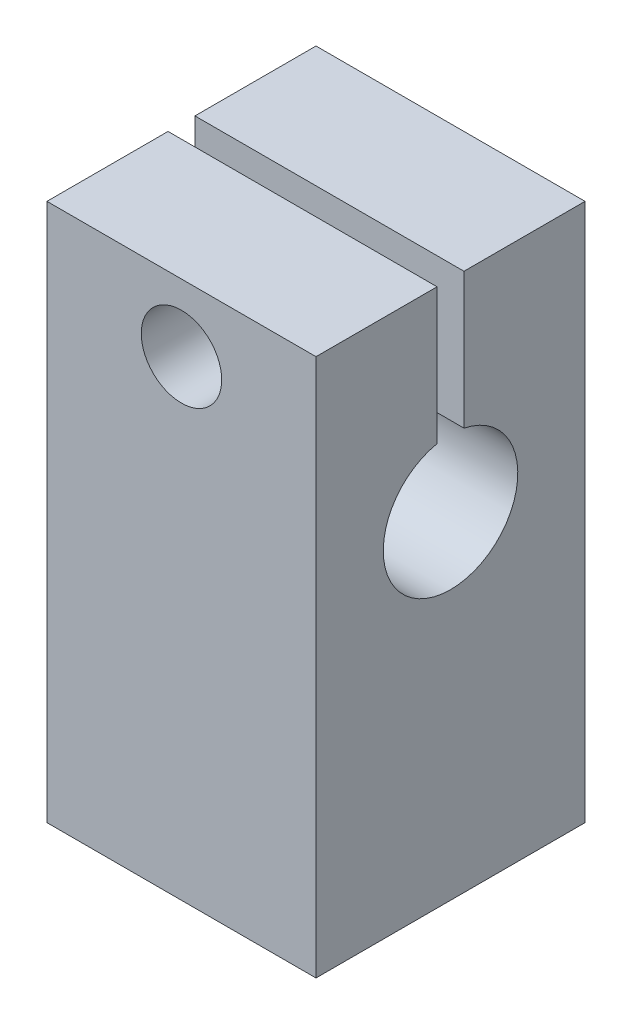
ISO-10303-21;
HEADER;
FILE_DESCRIPTION(('STEP AP214'),'2;1');
FILE_NAME('part.step','',(''),(''),'','','');
FILE_SCHEMA(('AUTOMOTIVE_DESIGN { 1 0 10303 214 1 1 1 1 }'));
ENDSEC;
DATA;
#1=APPLICATION_CONTEXT('core data for automotive mechanical design processes');
#2=APPLICATION_PROTOCOL_DEFINITION('international standard','automotive_design',2000,#1);
#3=PRODUCT_CONTEXT('',#1,'mechanical');
#4=PRODUCT('Part','Part','',(#3));
#5=PRODUCT_RELATED_PRODUCT_CATEGORY('part','',(#4));
#6=PRODUCT_DEFINITION_FORMATION('','',#4);
#7=PRODUCT_DEFINITION_CONTEXT('part definition',#1,'design');
#8=PRODUCT_DEFINITION('design','',#6,#7);
#9=PRODUCT_DEFINITION_SHAPE('','',#8);
#10=(LENGTH_UNIT() NAMED_UNIT(*) SI_UNIT(.MILLI.,.METRE.));
#11=(NAMED_UNIT(*) PLANE_ANGLE_UNIT() SI_UNIT($,.RADIAN.));
#12=(NAMED_UNIT(*) SI_UNIT($,.STERADIAN.) SOLID_ANGLE_UNIT());
#13=UNCERTAINTY_MEASURE_WITH_UNIT(LENGTH_MEASURE(1.E-05),#10,'distance_accuracy_value','');
#14=(GEOMETRIC_REPRESENTATION_CONTEXT(3) GLOBAL_UNCERTAINTY_ASSIGNED_CONTEXT((#13)) GLOBAL_UNIT_ASSIGNED_CONTEXT((#10,
#11,#12)) REPRESENTATION_CONTEXT('',''));
#15=CARTESIAN_POINT('',(0.,0.,0.));
#16=DIRECTION('',(0.,0.,1.));
#17=DIRECTION('',(1.,0.,0.));
#18=AXIS2_PLACEMENT_3D('',#15,#16,#17);
#19=CARTESIAN_POINT('',(0.,25.4,0.));
#20=DIRECTION('',(0.,-1.,0.));
#21=DIRECTION('',(0.,0.,-1.));
#22=AXIS2_PLACEMENT_3D('',#19,#20,#21);
#23=PLANE('',#22);
#24=DIRECTION('',(0.,0.,1.));
#25=VECTOR('',#24,1.);
#26=CARTESIAN_POINT('',(0.,25.4,0.));
#27=LINE('',#26,#25);
#28=CARTESIAN_POINT('',(0.,25.4,-12.7));
#29=VERTEX_POINT('',#28);
#30=CARTESIAN_POINT('',(0.,25.4,-6.985));
#31=VERTEX_POINT('',#30);
#32=EDGE_CURVE('E237',#29,#31,#27,.T.);
#33=ORIENTED_EDGE('',*,*,#32,.T.);
#34=DIRECTION('',(1.,0.,0.));
#35=VECTOR('',#34,1.);
#36=CARTESIAN_POINT('',(0.,25.4,-6.985));
#37=LINE('',#36,#35);
#38=CARTESIAN_POINT('',(12.7,25.4,-6.985));
#39=VERTEX_POINT('',#38);
#40=EDGE_CURVE('E238',#31,#39,#37,.T.);
#41=ORIENTED_EDGE('',*,*,#40,.T.);
#42=DIRECTION('',(0.,0.,-1.));
#43=VECTOR('',#42,1.);
#44=CARTESIAN_POINT('',(12.7,25.4,0.));
#45=LINE('',#44,#43);
#46=CARTESIAN_POINT('',(12.7,25.4,-12.7));
#47=VERTEX_POINT('',#46);
#48=EDGE_CURVE('E248',#39,#47,#45,.T.);
#49=ORIENTED_EDGE('',*,*,#48,.T.);
#50=DIRECTION('',(-1.,0.,0.));
#51=VECTOR('',#50,1.);
#52=CARTESIAN_POINT('',(0.,25.4,-12.7));
#53=LINE('',#52,#51);
#54=EDGE_CURVE('E241',#47,#29,#53,.T.);
#55=ORIENTED_EDGE('',*,*,#54,.T.);
#56=EDGE_LOOP('',(#33,#41,#49,#55));
#57=FACE_BOUND('',#56,.T.);
#58=ADVANCED_FACE('F33',(#57),#23,.F.);
#59=CARTESIAN_POINT('',(0.,25.4,0.));
#60=DIRECTION('',(1.,0.,0.));
#61=DIRECTION('',(0.,0.,-1.));
#62=AXIS2_PLACEMENT_3D('',#59,#60,#61);
#63=PLANE('',#62);
#64=CARTESIAN_POINT('',(0.,15.875,-6.35));
#65=DIRECTION('',(1.,0.,0.));
#66=DIRECTION('',(0.,0.,-1.));
#67=AXIS2_PLACEMENT_3D('',#64,#65,#66);
#68=CIRCLE('',#67,3.175);
#69=CARTESIAN_POINT('',(0.,18.9858519733346,-5.715));
#70=VERTEX_POINT('',#69);
#71=CARTESIAN_POINT('',(0.,18.9858519733346,-6.985));
#72=VERTEX_POINT('',#71);
#73=EDGE_CURVE('E145',#70,#72,#68,.T.);
#74=ORIENTED_EDGE('',*,*,#73,.T.);
#75=DIRECTION('',(0.,1.,0.));
#76=VECTOR('',#75,1.);
#77=CARTESIAN_POINT('',(0.,17.78,-6.985));
#78=LINE('',#77,#76);
#79=EDGE_CURVE('E299',#72,#31,#78,.T.);
#80=ORIENTED_EDGE('',*,*,#79,.T.);
#81=ORIENTED_EDGE('',*,*,#32,.F.);
#82=DIRECTION('',(0.,-1.,0.));
#83=VECTOR('',#82,1.);
#84=CARTESIAN_POINT('',(0.,25.4,-12.7));
#85=LINE('',#84,#83);
#86=CARTESIAN_POINT('',(0.,0.,-12.7));
#87=VERTEX_POINT('',#86);
#88=EDGE_CURVE('E258',#29,#87,#85,.T.);
#89=ORIENTED_EDGE('',*,*,#88,.T.);
#90=DIRECTION('',(0.,0.,1.));
#91=VECTOR('',#90,1.);
#92=CARTESIAN_POINT('',(0.,0.,0.));
#93=LINE('',#92,#91);
#94=CARTESIAN_POINT('',(0.,0.,0.));
#95=VERTEX_POINT('',#94);
#96=EDGE_CURVE('E259',#87,#95,#93,.T.);
#97=ORIENTED_EDGE('',*,*,#96,.T.);
#98=DIRECTION('',(0.,-1.,0.));
#99=VECTOR('',#98,1.);
#100=CARTESIAN_POINT('',(0.,25.4,0.));
#101=LINE('',#100,#99);
#102=CARTESIAN_POINT('',(0.,25.4,0.));
#103=VERTEX_POINT('',#102);
#104=EDGE_CURVE('E150',#103,#95,#101,.T.);
#105=ORIENTED_EDGE('',*,*,#104,.F.);
#106=CARTESIAN_POINT('',(0.,25.4,-5.715));
#107=VERTEX_POINT('',#106);
#108=EDGE_CURVE('E246',#107,#103,#27,.T.);
#109=ORIENTED_EDGE('',*,*,#108,.F.);
#110=DIRECTION('',(0.,-1.,0.));
#111=VECTOR('',#110,1.);
#112=CARTESIAN_POINT('',(0.,17.78,-5.715));
#113=LINE('',#112,#111);
#114=EDGE_CURVE('E297',#107,#70,#113,.T.);
#115=ORIENTED_EDGE('',*,*,#114,.T.);
#116=EDGE_LOOP('',(#74,#80,#81,#89,#97,#105,#109,#115));
#117=FACE_BOUND('',#116,.T.);
#118=ADVANCED_FACE('F168',(#117),#63,.F.);
#119=CARTESIAN_POINT('',(0.,25.4,0.));
#120=DIRECTION('',(0.,0.,-1.));
#121=DIRECTION('',(-1.,0.,0.));
#122=AXIS2_PLACEMENT_3D('',#119,#120,#121);
#123=PLANE('',#122);
#124=CARTESIAN_POINT('',(6.35,22.225,0.));
#125=DIRECTION('',(0.,0.,1.));
#126=DIRECTION('',(1.,0.,0.));
#127=AXIS2_PLACEMENT_3D('',#124,#125,#126);
#128=CIRCLE('',#127,1.89864999999999);
#129=CARTESIAN_POINT('',(8.24864999999999,22.225,0.));
#130=VERTEX_POINT('',#129);
#131=EDGE_CURVE('E314',#130,#130,#128,.T.);
#132=ORIENTED_EDGE('',*,*,#131,.F.);
#133=EDGE_LOOP('',(#132));
#134=FACE_BOUND('',#133,.T.);
#135=DIRECTION('',(1.,0.,0.));
#136=VECTOR('',#135,1.);
#137=CARTESIAN_POINT('',(0.,0.,0.));
#138=LINE('',#137,#136);
#139=CARTESIAN_POINT('',(12.7,0.,0.));
#140=VERTEX_POINT('',#139);
#141=EDGE_CURVE('E262',#95,#140,#138,.T.);
#142=ORIENTED_EDGE('',*,*,#141,.T.);
#143=DIRECTION('',(0.,-1.,0.));
#144=VECTOR('',#143,1.);
#145=CARTESIAN_POINT('',(12.7,25.4,0.));
#146=LINE('',#145,#144);
#147=CARTESIAN_POINT('',(12.7,25.4,0.));
#148=VERTEX_POINT('',#147);
#149=EDGE_CURVE('E270',#148,#140,#146,.T.);
#150=ORIENTED_EDGE('',*,*,#149,.F.);
#151=DIRECTION('',(1.,0.,0.));
#152=VECTOR('',#151,1.);
#153=CARTESIAN_POINT('',(0.,25.4,0.));
#154=LINE('',#153,#152);
#155=EDGE_CURVE('E245',#103,#148,#154,.T.);
#156=ORIENTED_EDGE('',*,*,#155,.F.);
#157=ORIENTED_EDGE('',*,*,#104,.T.);
#158=EDGE_LOOP('',(#142,#150,#156,#157));
#159=FACE_BOUND('',#158,.T.);
#160=ADVANCED_FACE('F172',(#134,#159),#123,.F.);
#161=CARTESIAN_POINT('',(12.7,25.4,0.));
#162=DIRECTION('',(-1.,0.,0.));
#163=DIRECTION('',(0.,0.,1.));
#164=AXIS2_PLACEMENT_3D('',#161,#162,#163);
#165=PLANE('',#164);
#166=ORIENTED_EDGE('',*,*,#48,.F.);
#167=DIRECTION('',(0.,1.,0.));
#168=VECTOR('',#167,1.);
#169=CARTESIAN_POINT('',(12.7,17.78,-6.985));
#170=LINE('',#169,#168);
#171=CARTESIAN_POINT('',(12.7,18.9858519733346,-6.985));
#172=VERTEX_POINT('',#171);
#173=EDGE_CURVE('E139',#172,#39,#170,.T.);
#174=ORIENTED_EDGE('',*,*,#173,.F.);
#175=CARTESIAN_POINT('',(12.7,15.875,-6.35));
#176=DIRECTION('',(1.,0.,0.));
#177=DIRECTION('',(0.,0.,-1.));
#178=AXIS2_PLACEMENT_3D('',#175,#176,#177);
#179=CIRCLE('',#178,3.17499999999999);
#180=CARTESIAN_POINT('',(12.7,18.9858519733346,-5.715));
#181=VERTEX_POINT('',#180);
#182=EDGE_CURVE('E289',#181,#172,#179,.T.);
#183=ORIENTED_EDGE('',*,*,#182,.F.);
#184=DIRECTION('',(0.,-1.,0.));
#185=VECTOR('',#184,1.);
#186=CARTESIAN_POINT('',(12.7,17.78,-5.715));
#187=LINE('',#186,#185);
#188=CARTESIAN_POINT('',(12.7,25.4,-5.715));
#189=VERTEX_POINT('',#188);
#190=EDGE_CURVE('E291',#189,#181,#187,.T.);
#191=ORIENTED_EDGE('',*,*,#190,.F.);
#192=EDGE_CURVE('E254',#148,#189,#45,.T.);
#193=ORIENTED_EDGE('',*,*,#192,.F.);
#194=ORIENTED_EDGE('',*,*,#149,.T.);
#195=DIRECTION('',(0.,0.,-1.));
#196=VECTOR('',#195,1.);
#197=CARTESIAN_POINT('',(12.7,0.,0.));
#198=LINE('',#197,#196);
#199=CARTESIAN_POINT('',(12.7,0.,-12.7));
#200=VERTEX_POINT('',#199);
#201=EDGE_CURVE('E264',#140,#200,#198,.T.);
#202=ORIENTED_EDGE('',*,*,#201,.T.);
#203=DIRECTION('',(0.,-1.,0.));
#204=VECTOR('',#203,1.);
#205=CARTESIAN_POINT('',(12.7,25.4,-12.7));
#206=LINE('',#205,#204);
#207=EDGE_CURVE('E268',#47,#200,#206,.T.);
#208=ORIENTED_EDGE('',*,*,#207,.F.);
#209=EDGE_LOOP('',(#166,#174,#183,#191,#193,#194,#202,#208));
#210=FACE_BOUND('',#209,.T.);
#211=ADVANCED_FACE('F176',(#210),#165,.F.);
#212=CARTESIAN_POINT('',(0.,25.4,-12.7));
#213=DIRECTION('',(0.,0.,1.));
#214=DIRECTION('',(1.,0.,0.));
#215=AXIS2_PLACEMENT_3D('',#212,#213,#214);
#216=PLANE('',#215);
#217=CARTESIAN_POINT('',(6.35,22.225,-12.7));
#218=DIRECTION('',(0.,0.,1.));
#219=DIRECTION('',(1.,0.,0.));
#220=AXIS2_PLACEMENT_3D('',#217,#218,#219);
#221=CIRCLE('',#220,1.35254999999999);
#222=CARTESIAN_POINT('',(7.70254999999999,22.225,-12.7));
#223=VERTEX_POINT('',#222);
#224=EDGE_CURVE('E319',#223,#223,#221,.T.);
#225=ORIENTED_EDGE('',*,*,#224,.T.);
#226=EDGE_LOOP('',(#225));
#227=FACE_BOUND('',#226,.T.);
#228=DIRECTION('',(-1.,0.,0.));
#229=VECTOR('',#228,1.);
#230=CARTESIAN_POINT('',(0.,0.,-12.7));
#231=LINE('',#230,#229);
#232=EDGE_CURVE('E250',#200,#87,#231,.T.);
#233=ORIENTED_EDGE('',*,*,#232,.T.);
#234=ORIENTED_EDGE('',*,*,#88,.F.);
#235=ORIENTED_EDGE('',*,*,#54,.F.);
#236=ORIENTED_EDGE('',*,*,#207,.T.);
#237=EDGE_LOOP('',(#233,#234,#235,#236));
#238=FACE_BOUND('',#237,.T.);
#239=ADVANCED_FACE('F180',(#227,#238),#216,.F.);
#240=ORIENTED_EDGE('',*,*,#192,.T.);
#241=DIRECTION('',(1.,0.,0.));
#242=VECTOR('',#241,1.);
#243=CARTESIAN_POINT('',(0.,25.4,-5.715));
#244=LINE('',#243,#242);
#245=EDGE_CURVE('E294',#107,#189,#244,.T.);
#246=ORIENTED_EDGE('',*,*,#245,.F.);
#247=ORIENTED_EDGE('',*,*,#108,.T.);
#248=ORIENTED_EDGE('',*,*,#155,.T.);
#249=EDGE_LOOP('',(#240,#246,#247,#248));
#250=FACE_BOUND('',#249,.T.);
#251=ADVANCED_FACE('F184',(#250),#23,.F.);
#252=CARTESIAN_POINT('',(0.,0.,0.));
#253=DIRECTION('',(0.,-1.,0.));
#254=DIRECTION('',(0.,0.,-1.));
#255=AXIS2_PLACEMENT_3D('',#252,#253,#254);
#256=PLANE('',#255);
#257=CARTESIAN_POINT('',(6.35,0.,-6.35));
#258=DIRECTION('',(0.,-1.,0.));
#259=DIRECTION('',(0.,0.,-1.));
#260=AXIS2_PLACEMENT_3D('',#257,#258,#259);
#261=CIRCLE('',#260,2.01929999999999);
#262=CARTESIAN_POINT('',(6.35,0.,-8.36929999999999));
#263=VERTEX_POINT('',#262);
#264=EDGE_CURVE('E308',#263,#263,#261,.T.);
#265=ORIENTED_EDGE('',*,*,#264,.F.);
#266=EDGE_LOOP('',(#265));
#267=FACE_BOUND('',#266,.T.);
#268=ORIENTED_EDGE('',*,*,#96,.F.);
#269=ORIENTED_EDGE('',*,*,#232,.F.);
#270=ORIENTED_EDGE('',*,*,#201,.F.);
#271=ORIENTED_EDGE('',*,*,#141,.F.);
#272=EDGE_LOOP('',(#268,#269,#270,#271));
#273=FACE_BOUND('',#272,.T.);
#274=ADVANCED_FACE('F166',(#267,#273),#256,.T.);
#275=CARTESIAN_POINT('',(12.7,15.875,-6.35));
#276=DIRECTION('',(1.,0.,0.));
#277=DIRECTION('',(0.,0.,-1.));
#278=AXIS2_PLACEMENT_3D('',#275,#276,#277);
#279=CYLINDRICAL_SURFACE('',#278,3.17499999999999);
#280=CARTESIAN_POINT('',(6.35,13.4248872454518,-8.36929999999999));
#281=CARTESIAN_POINT('',(6.44994127069753,13.4248718204845,-8.36929051569735));
#282=CARTESIAN_POINT('',(6.549972329925,13.418659892792,-8.3618162399891));
#283=CARTESIAN_POINT('',(6.74657968147831,13.3949361498304,-8.33248167673375));
#284=CARTESIAN_POINT('',(6.84314874208904,13.3774019877287,-8.31059293748517));
#285=CARTESIAN_POINT('',(7.02943627589822,13.3340302130215,-8.25403316035159));
#286=CARTESIAN_POINT('',(7.11920652404968,13.3082653104803,-8.21947367457506));
#287=CARTESIAN_POINT('',(7.29156455142342,13.2514603512461,-8.13888009345359));
#288=CARTESIAN_POINT('',(7.37415088122779,13.2204192337456,-8.09284368975069));
#289=CARTESIAN_POINT('',(7.5424415102559,13.1513477904697,-7.98312725242593));
#290=CARTESIAN_POINT('',(7.6269732450019,13.1129465691412,-7.91788172310624));
#291=CARTESIAN_POINT('',(7.78489017756889,13.036480845333,-7.774790452318));
#292=CARTESIAN_POINT('',(7.85826567508319,12.9984166626801,-7.69693386567764));
#293=CARTESIAN_POINT('',(8.00100661538207,12.9212179961091,-7.51891001207363));
#294=CARTESIAN_POINT('',(8.06868834305824,12.8825580925701,-7.4171660627161));
#295=CARTESIAN_POINT('',(8.18541857889044,12.814022538985,-7.20080527122574));
#296=CARTESIAN_POINT('',(8.23448605031166,12.7841379561383,-7.08620168495757));
#297=CARTESIAN_POINT('',(8.30705734525045,12.7393337358169,-6.85999490435427));
#298=CARTESIAN_POINT('',(8.33269558748184,12.7231772656241,-6.74932809127586));
#299=CARTESIAN_POINT('',(8.36497014691782,12.7027780327517,-6.5242211383964));
#300=CARTESIAN_POINT('',(8.37162742668431,12.6985221271968,-6.40978530255688));
#301=CARTESIAN_POINT('',(8.36593994541017,12.7021348606102,-6.19757587241871));
#302=CARTESIAN_POINT('',(8.35610476842585,12.7084023774493,-6.09969452944579));
#303=CARTESIAN_POINT('',(8.32259302412571,12.7295261587167,-5.90730198179126));
#304=CARTESIAN_POINT('',(8.29891541632401,12.744383068778,-5.81279103101663));
#305=CARTESIAN_POINT('',(8.23881504253609,12.7814394659816,-5.6293874731207));
#306=CARTESIAN_POINT('',(8.2023797110953,12.8036461909862,-5.5405005075111));
#307=CARTESIAN_POINT('',(8.11814027782338,12.8537045468767,-5.37005126079343));
#308=CARTESIAN_POINT('',(8.07033373547795,12.8815573893549,-5.28849055724774));
#309=CARTESIAN_POINT('',(7.95794609088178,12.9447930310557,-5.12393765245594));
#310=CARTESIAN_POINT('',(7.89200822513682,12.9806826403334,-5.04206867631601));
#311=CARTESIAN_POINT('',(7.74873303530302,13.0544097301348,-4.8898397704077));
#312=CARTESIAN_POINT('',(7.67137875571948,13.0922500524805,-4.81949729331192));
#313=CARTESIAN_POINT('',(7.49503891610956,13.1718300197859,-4.68249051900059));
#314=CARTESIAN_POINT('',(7.39454168042348,13.2133928471224,-4.61765322716934));
#315=CARTESIAN_POINT('',(7.1816089961782,13.2894983164918,-4.50598705959556));
#316=CARTESIAN_POINT('',(7.06919576286591,13.3240536839999,-4.45912539971896));
#317=CARTESIAN_POINT('',(6.86636060127733,13.3724462991688,-4.39577582910408));
#318=CARTESIAN_POINT('',(6.77817038933682,13.3893569764089,-4.37450659403429));
#319=CARTESIAN_POINT('',(6.59852371563981,13.4139143226429,-4.34398927814206));
#320=CARTESIAN_POINT('',(6.50707222444305,13.4215745172526,-4.33472364477658));
#321=CARTESIAN_POINT('',(6.32321667144573,13.4264681995785,-4.32877851447893));
#322=CARTESIAN_POINT('',(6.23081067847946,13.4236728813347,-4.33213378952672));
#323=CARTESIAN_POINT('',(6.04813534005661,13.4080452586024,-4.3512751774674));
#324=CARTESIAN_POINT('',(5.95786784545298,13.3952045650003,-4.36707168037721));
#325=CARTESIAN_POINT('',(5.78393908196718,13.3617661952081,-4.40964396236594));
#326=CARTESIAN_POINT('',(5.70017087309287,13.3413635096095,-4.43614514008871));
#327=CARTESIAN_POINT('',(5.53810707475902,13.2950427047881,-4.49906288566871));
#328=CARTESIAN_POINT('',(5.45981332378446,13.2691227444074,-4.5354827646108));
#329=CARTESIAN_POINT('',(5.29478481532052,13.2086281484365,-4.62531137130682));
#330=CARTESIAN_POINT('',(5.20935645675551,13.1733498566102,-4.68064488347245));
#331=CARTESIAN_POINT('',(5.04802926072512,13.1013807830223,-4.80315775732268));
#332=CARTESIAN_POINT('',(4.97214185189078,13.0646883747884,-4.87035109812373));
#333=CARTESIAN_POINT('',(4.81850442417588,12.9865016846256,-5.02853042402019));
#334=CARTESIAN_POINT('',(4.74275420866531,12.9452913359774,-5.12162234449835));
#335=CARTESIAN_POINT('',(4.60805670958563,12.8692830239004,-5.32156074905778));
#336=CARTESIAN_POINT('',(4.54909062174493,12.8344778998941,-5.42839164408474));
#337=CARTESIAN_POINT('',(4.46057226245438,12.7811328478677,-5.63078370029887));
#338=CARTESIAN_POINT('',(4.42749343239506,12.7607311069293,-5.72431232976873));
#339=CARTESIAN_POINT('',(4.37526158788784,12.7282203802321,-5.91655049354686));
#340=CARTESIAN_POINT('',(4.35609750336512,12.7161048027441,-6.01525584225593));
#341=CARTESIAN_POINT('',(4.33266164553879,12.7012604219405,-6.21545014195493));
#342=CARTESIAN_POINT('',(4.3284362316746,12.6985608397965,-6.3169467748711));
#343=CARTESIAN_POINT('',(4.33525996732009,12.7028992954706,-6.51922071760689));
#344=CARTESIAN_POINT('',(4.34631055621006,12.7099382509017,-6.61999795874248));
#345=CARTESIAN_POINT('',(4.38214457582786,12.7324966273919,-6.81290316933866));
#346=CARTESIAN_POINT('',(4.40623382787444,12.7475868626478,-6.90521341017946));
#347=CARTESIAN_POINT('',(4.46655540013465,12.7847164308817,-7.08426232412819));
#348=CARTESIAN_POINT('',(4.50278969808064,12.8067568956194,-7.17100008705546));
#349=CARTESIAN_POINT('',(4.58937247564594,12.8581221853885,-7.34389647575407));
#350=CARTESIAN_POINT('',(4.64060130435253,12.8878810474206,-7.42948239570686));
#351=CARTESIAN_POINT('',(4.7541997608168,12.9514041024464,-7.59128256073288));
#352=CARTESIAN_POINT('',(4.81657848984223,12.9851715598941,-7.66748906326209));
#353=CARTESIAN_POINT('',(4.96148577966154,13.0595819599213,-7.82048578378875));
#354=CARTESIAN_POINT('',(5.04563535064112,13.1004913839883,-7.89561455035015));
#355=CARTESIAN_POINT('',(5.22584642528027,13.1805132049022,-8.03123983029399));
#356=CARTESIAN_POINT('',(5.32191080844168,13.2196251642061,-8.0917327961185));
#357=CARTESIAN_POINT('',(5.50977299516957,13.2860810267344,-8.18876550837132));
#358=CARTESIAN_POINT('',(5.60010791563855,13.3143098093807,-8.22752281278316));
#359=CARTESIAN_POINT('',(5.78730054967501,13.3627121503796,-8.29182185539048));
#360=CARTESIAN_POINT('',(5.88414010978251,13.3829071205492,-8.31739877665448));
#361=CARTESIAN_POINT('',(6.04316120028777,13.4064664372994,-8.34678820017445));
#362=CARTESIAN_POINT('',(6.10400506264097,13.4133261606242,-8.35520384926546));
#363=CARTESIAN_POINT('',(6.22655447596037,13.4225415345756,-8.36646293280567));
#364=CARTESIAN_POINT('',(6.28826010500031,13.4248967744066,-8.36930585903946));
#365=CARTESIAN_POINT('',(6.35,13.4248872454518,-8.36929999999999));
#366=B_SPLINE_CURVE_WITH_KNOTS('',3,(#280,#281,#282,#283,#284,#285,#286,#287,#288,#289,#290,
#291,#292,#293,#294,#295,#296,#297,#298,#299,#300,#301,#302,#303,#304,#305,#306,#307,#308,#309,
#310,#311,#312,#313,#314,#315,#316,#317,#318,#319,#320,#321,#322,#323,#324,#325,#326,#327,#328,
#329,#330,#331,#332,#333,#334,#335,#336,#337,#338,#339,#340,#341,#342,#343,#344,#345,#346,#347,
#348,#349,#350,#351,#352,#353,#354,#355,#356,#357,#358,#359,#360,#361,#362,#363,#364,#365),
.UNSPECIFIED.,.T.,.F.,(4,2,2,2,2,2,2,2,2,2,2,2,2,2,2,2,2,2,2,2,2,2,2,2,2,2,2,2,2,2,2,2,2,2,2,2,
2,2,2,2,2,2,4),(0.,0.299545346163702,0.59968372326275,0.897240786031997,1.19485774494705,
1.53399780499747,1.87343108015559,2.25583678812835,2.63785186753817,2.97997514749979,
3.32172044011373,3.61602438944011,3.91035046338391,4.20496724691205,4.49964731888725,
4.831591447703,5.16403363102356,5.54206146658145,5.9193965355226,6.19510071677626,
6.47040128648608,6.74646089414033,7.02275129165824,7.29236365357902,7.56206612870596,
7.88405755850047,8.20643108372257,8.58524226804168,8.96362736164551,9.26617640041808,
9.56848447745552,9.87172989295245,10.175003883675,10.4635252097641,10.7520935422965,
11.0631665349708,11.37449461478,11.7329995987663,12.0915913935742,12.3972580961101,
12.7021045844747,12.887135370411,13.0721830298085),.UNSPECIFIED.);
#367=CARTESIAN_POINT('',(6.35,13.4248872454518,-8.36929999999999));
#368=VERTEX_POINT('',#367);
#369=EDGE_CURVE('E205',#368,#368,#366,.T.);
#370=ORIENTED_EDGE('',*,*,#369,.T.);
#371=EDGE_LOOP('',(#370));
#372=FACE_BOUND('',#371,.T.);
#373=DIRECTION('',(1.,0.,0.));
#374=VECTOR('',#373,1.);
#375=CARTESIAN_POINT('',(12.7,18.9858519733346,-6.985));
#376=LINE('',#375,#374);
#377=CARTESIAN_POINT('',(8.2668587558816,18.9858519733346,-6.985));
#378=VERTEX_POINT('',#377);
#379=EDGE_CURVE('E132',#172,#378,#376,.F.);
#380=ORIENTED_EDGE('',*,*,#379,.T.);
#381=CARTESIAN_POINT('',(8.2668587558816,18.9858519733346,-6.985));
#382=CARTESIAN_POINT('',(8.24868611748164,18.974659079241,-7.03986030764481));
#383=CARTESIAN_POINT('',(8.22825144149655,18.9621610830179,-7.0936522139659));
#384=CARTESIAN_POINT('',(8.1831442196891,18.9349250400993,-7.19877744209236));
#385=CARTESIAN_POINT('',(8.15847580646516,18.9201891794084,-7.2501130995636));
#386=CARTESIAN_POINT('',(8.07882112023288,18.8733376568329,-7.39948729229108));
#387=CARTESIAN_POINT('',(8.01795204926204,18.8384295463588,-7.49358305348349));
#388=CARTESIAN_POINT('',(7.88290712858724,18.7645790401786,-7.66909646699984));
#389=CARTESIAN_POINT('',(7.80877975413472,18.7256515523365,-7.75055835065127));
#390=CARTESIAN_POINT('',(7.64831226876995,18.6469605123353,-7.90049800260982));
#391=CARTESIAN_POINT('',(7.56193709669832,18.607194849126,-7.96893712614874));
#392=CARTESIAN_POINT('',(7.36970292308979,18.5272608190322,-8.09709611289349));
#393=CARTESIAN_POINT('',(7.26278113834591,18.4873946098073,-8.15542643711124));
#394=CARTESIAN_POINT('',(7.03757655861187,18.4175402960356,-8.25255763196066));
#395=CARTESIAN_POINT('',(6.91933263917528,18.3875198527536,-8.29142266328695));
#396=CARTESIAN_POINT('',(6.71087627204594,18.3500905313102,-8.33876203609517));
#397=CARTESIAN_POINT('',(6.62265409733869,18.3386273891137,-8.35281389550343));
#398=CARTESIAN_POINT('',(6.44443460853902,18.325328664223,-8.36906823635917));
#399=CARTESIAN_POINT('',(6.35443911418668,18.3234836803368,-8.3712822886311));
#400=CARTESIAN_POINT('',(6.17534789836429,18.3296971757324,-8.36372917307086));
#401=CARTESIAN_POINT('',(6.08625190845094,18.3377526066749,-8.35396569312447));
#402=CARTESIAN_POINT('',(5.91127660800948,18.3625682064671,-8.32307137228648));
#403=CARTESIAN_POINT('',(5.82540122140748,18.3793386463032,-8.30192711764315));
#404=CARTESIAN_POINT('',(5.6361922477146,18.4249054662489,-8.24218402332433));
#405=CARTESIAN_POINT('',(5.53434956689117,18.4557204684736,-8.20042563640849));
#406=CARTESIAN_POINT('',(5.34024491554236,18.5234587389797,-8.10209914358609));
#407=CARTESIAN_POINT('',(5.24800043451629,18.5603928505934,-8.04550464186572));
#408=CARTESIAN_POINT('',(5.07291134851694,18.6368330204656,-7.91796460483892));
#409=CARTESIAN_POINT('',(4.99022524664932,18.6763689532718,-7.84681992857649));
#410=CARTESIAN_POINT('',(4.83713846183501,18.7537938326056,-7.69188589419964));
#411=CARTESIAN_POINT('',(4.76671318732078,18.7916859587095,-7.60812249029395));
#412=CARTESIAN_POINT('',(4.64622624142724,18.858902555583,-7.43829192230636));
#413=CARTESIAN_POINT('',(4.59480223152226,18.8887089346886,-7.35339228567476));
#414=CARTESIAN_POINT('',(4.52694712845154,18.928889777171,-7.2198060490676));
#415=CARTESIAN_POINT('',(4.50584090768305,18.9415505070949,-7.17413480049431));
#416=CARTESIAN_POINT('',(4.46694820862593,18.9650972022589,-7.08091792861932));
#417=CARTESIAN_POINT('',(4.44916424094679,18.9759818245242,-7.03337092041502));
#418=CARTESIAN_POINT('',(4.4331412441184,18.9858519733346,-6.985));
#419=B_SPLINE_CURVE_WITH_KNOTS('',3,(#381,#382,#383,#384,#385,#386,#387,#388,#389,#390,#391,
#392,#393,#394,#395,#396,#397,#398,#399,#400,#401,#402,#403,#404,#405,#406,#407,#408,#409,#410,
#411,#412,#413,#414,#415,#416,#417,#418),.UNSPECIFIED.,.F.,.F.,(4,2,2,2,2,2,2,2,2,2,2,2,2,2,2,2,
2,2,4),(0.,0.176445167260401,0.35271907390457,0.703068551889586,1.05216232916859,
1.40227640886311,1.78473386058608,2.16592223590023,2.43494031001803,2.7036953851957,
2.97236773136972,3.24135743917612,3.58245324013184,3.92416007290691,4.27090104758919,
4.61693834386975,4.92660449856964,5.08209538438945,5.23770330269891),.UNSPECIFIED.);
#420=CARTESIAN_POINT('',(4.4331412441184,18.9858519733346,-6.985));
#421=VERTEX_POINT('',#420);
#422=EDGE_CURVE('E131',#378,#421,#419,.T.);
#423=ORIENTED_EDGE('',*,*,#422,.T.);
#424=EDGE_CURVE('E146',#421,#72,#376,.F.);
#425=ORIENTED_EDGE('',*,*,#424,.T.);
#426=ORIENTED_EDGE('',*,*,#73,.F.);
#427=DIRECTION('',(1.,0.,0.));
#428=VECTOR('',#427,1.);
#429=CARTESIAN_POINT('',(12.7,18.9858519733346,-5.715));
#430=LINE('',#429,#428);
#431=CARTESIAN_POINT('',(4.4331412441184,18.9858519733346,-5.715));
#432=VERTEX_POINT('',#431);
#433=EDGE_CURVE('E136',#70,#432,#430,.T.);
#434=ORIENTED_EDGE('',*,*,#433,.T.);
#435=CARTESIAN_POINT('',(4.4331412441184,18.9858519733346,-5.715));
#436=CARTESIAN_POINT('',(4.45131388251836,18.974659079241,-5.66013969235518));
#437=CARTESIAN_POINT('',(4.47174855850345,18.9621610830179,-5.60634778603409));
#438=CARTESIAN_POINT('',(4.5168557803109,18.9349250400993,-5.50122255790764));
#439=CARTESIAN_POINT('',(4.54152419353484,18.9201891794084,-5.44988690043639));
#440=CARTESIAN_POINT('',(4.62117887976712,18.8733376568329,-5.30051270770891));
#441=CARTESIAN_POINT('',(4.68204795073796,18.8384295463588,-5.2064169465165));
#442=CARTESIAN_POINT('',(4.81709287141276,18.7645790401786,-5.03090353300016));
#443=CARTESIAN_POINT('',(4.89122024586528,18.7256515523365,-4.94944164934873));
#444=CARTESIAN_POINT('',(5.05168773123005,18.6469605123353,-4.79950199739017));
#445=CARTESIAN_POINT('',(5.13806290330169,18.607194849126,-4.73106287385126));
#446=CARTESIAN_POINT('',(5.33029707691021,18.5272608190322,-4.60290388710651));
#447=CARTESIAN_POINT('',(5.43721886165409,18.4873946098073,-4.54457356288876));
#448=CARTESIAN_POINT('',(5.66242344138814,18.4175402960356,-4.44744236803934));
#449=CARTESIAN_POINT('',(5.78066736082472,18.3875198527537,-4.40857733671304));
#450=CARTESIAN_POINT('',(5.98912372795407,18.3500905313102,-4.36123796390483));
#451=CARTESIAN_POINT('',(6.07734590266131,18.3386273891137,-4.34718610449657));
#452=CARTESIAN_POINT('',(6.25556539146099,18.325328664223,-4.33093176364083));
#453=CARTESIAN_POINT('',(6.34556088581332,18.3234836803368,-4.3287177113689));
#454=CARTESIAN_POINT('',(6.52465210163571,18.3296971757324,-4.33627082692914));
#455=CARTESIAN_POINT('',(6.61374809154907,18.3377526066749,-4.34603430687553));
#456=CARTESIAN_POINT('',(6.78872339199053,18.3625682064671,-4.37692862771352));
#457=CARTESIAN_POINT('',(6.87459877859253,18.3793386463032,-4.39807288235685));
#458=CARTESIAN_POINT('',(7.0638077522854,18.4249054662489,-4.45781597667568));
#459=CARTESIAN_POINT('',(7.16565043310884,18.4557204684736,-4.49957436359151));
#460=CARTESIAN_POINT('',(7.35975508445765,18.5234587389797,-4.59790085641392));
#461=CARTESIAN_POINT('',(7.45199956548371,18.5603928505934,-4.65449535813428));
#462=CARTESIAN_POINT('',(7.62708865148307,18.6368330204656,-4.78203539516109));
#463=CARTESIAN_POINT('',(7.70977475335069,18.6763689532718,-4.85318007142351));
#464=CARTESIAN_POINT('',(7.86286153816499,18.7537938326056,-5.00811410580037));
#465=CARTESIAN_POINT('',(7.93328681267923,18.7916859587095,-5.09187750970605));
#466=CARTESIAN_POINT('',(8.05377375857276,18.858902555583,-5.26170807769365));
#467=CARTESIAN_POINT('',(8.10519776847774,18.8887089346886,-5.34660771432524));
#468=CARTESIAN_POINT('',(8.17305287154846,18.928889777171,-5.4801939509324));
#469=CARTESIAN_POINT('',(8.19415909231695,18.9415505070949,-5.52586519950569));
#470=CARTESIAN_POINT('',(8.23305179137407,18.9650972022589,-5.61908207138067));
#471=CARTESIAN_POINT('',(8.25083575905321,18.9759818245242,-5.66662907958498));
#472=CARTESIAN_POINT('',(8.2668587558816,18.9858519733346,-5.715));
#473=B_SPLINE_CURVE_WITH_KNOTS('',3,(#435,#436,#437,#438,#439,#440,#441,#442,#443,#444,#445,
#446,#447,#448,#449,#450,#451,#452,#453,#454,#455,#456,#457,#458,#459,#460,#461,#462,#463,#464,
#465,#466,#467,#468,#469,#470,#471,#472),.UNSPECIFIED.,.F.,.F.,(4,2,2,2,2,2,2,2,2,2,2,2,2,2,2,2,
2,2,4),(0.,0.176445167260401,0.352719073904569,0.703068551889587,1.05216232916859,
1.40227640886311,1.78473386058608,2.16592223590023,2.43494031001803,2.7036953851957,
2.97236773136972,3.24135743917613,3.58245324013184,3.92416007290691,4.2709010475892,
4.61693834386975,4.92660449856963,5.08209538438944,5.23770330269889),.UNSPECIFIED.);
#474=CARTESIAN_POINT('',(8.2668587558816,18.9858519733346,-5.715));
#475=VERTEX_POINT('',#474);
#476=EDGE_CURVE('E121',#432,#475,#473,.T.);
#477=ORIENTED_EDGE('',*,*,#476,.T.);
#478=EDGE_CURVE('E147',#475,#181,#430,.T.);
#479=ORIENTED_EDGE('',*,*,#478,.T.);
#480=ORIENTED_EDGE('',*,*,#182,.T.);
#481=EDGE_LOOP('',(#380,#423,#425,#426,#434,#477,#479,#480));
#482=FACE_BOUND('',#481,.T.);
#483=ADVANCED_FACE('F143',(#372,#482),#279,.F.);
#484=CARTESIAN_POINT('',(0.,17.78,-5.715));
#485=DIRECTION('',(0.,0.,1.));
#486=DIRECTION('',(1.,0.,0.));
#487=AXIS2_PLACEMENT_3D('',#484,#485,#486);
#488=PLANE('',#487);
#489=CARTESIAN_POINT('',(6.35,22.225,-5.715));
#490=DIRECTION('',(0.,0.,1.));
#491=DIRECTION('',(1.,0.,0.));
#492=AXIS2_PLACEMENT_3D('',#489,#490,#491);
#493=CIRCLE('',#492,1.89864999999999);
#494=CARTESIAN_POINT('',(8.24864999999999,22.225,-5.715));
#495=VERTEX_POINT('',#494);
#496=EDGE_CURVE('E310',#495,#495,#493,.T.);
#497=ORIENTED_EDGE('',*,*,#496,.T.);
#498=EDGE_LOOP('',(#497));
#499=FACE_BOUND('',#498,.T.);
#500=DIRECTION('',(-1.,0.,0.));
#501=VECTOR('',#500,1.);
#502=CARTESIAN_POINT('',(0.,18.9868519733346,-5.715));
#503=LINE('',#502,#501);
#504=CARTESIAN_POINT('',(8.26685875588161,18.9868519733346,-5.715));
#505=VERTEX_POINT('',#504);
#506=CARTESIAN_POINT('',(4.43314124411839,18.9868519733346,-5.715));
#507=VERTEX_POINT('',#506);
#508=EDGE_CURVE('E138',#505,#507,#503,.T.);
#509=ORIENTED_EDGE('',*,*,#508,.T.);
#510=DIRECTION('',(0.,-1.,0.));
#511=VECTOR('',#510,1.);
#512=CARTESIAN_POINT('',(4.4331412441184,0.,-5.715));
#513=LINE('',#512,#511);
#514=EDGE_CURVE('E124',#507,#432,#513,.T.);
#515=ORIENTED_EDGE('',*,*,#514,.T.);
#516=ORIENTED_EDGE('',*,*,#433,.F.);
#517=ORIENTED_EDGE('',*,*,#114,.F.);
#518=ORIENTED_EDGE('',*,*,#245,.T.);
#519=ORIENTED_EDGE('',*,*,#190,.T.);
#520=ORIENTED_EDGE('',*,*,#478,.F.);
#521=DIRECTION('',(0.,-1.,0.));
#522=VECTOR('',#521,1.);
#523=CARTESIAN_POINT('',(8.2668587558816,0.,-5.715));
#524=LINE('',#523,#522);
#525=EDGE_CURVE('E127',#475,#505,#524,.F.);
#526=ORIENTED_EDGE('',*,*,#525,.T.);
#527=EDGE_LOOP('',(#509,#515,#516,#517,#518,#519,#520,#526));
#528=FACE_BOUND('',#527,.T.);
#529=ADVANCED_FACE('F135',(#499,#528),#488,.F.);
#530=CARTESIAN_POINT('',(0.,17.78,-6.985));
#531=DIRECTION('',(0.,0.,-1.));
#532=DIRECTION('',(-1.,0.,0.));
#533=AXIS2_PLACEMENT_3D('',#530,#531,#532);
#534=PLANE('',#533);
#535=CARTESIAN_POINT('',(6.35,22.225,-6.98499999999999));
#536=DIRECTION('',(0.,0.,1.));
#537=DIRECTION('',(1.,0.,0.));
#538=AXIS2_PLACEMENT_3D('',#535,#536,#537);
#539=CIRCLE('',#538,1.35254999999999);
#540=CARTESIAN_POINT('',(7.70254999999999,22.225,-6.98499999999999));
#541=VERTEX_POINT('',#540);
#542=EDGE_CURVE('E322',#541,#541,#539,.T.);
#543=ORIENTED_EDGE('',*,*,#542,.F.);
#544=EDGE_LOOP('',(#543));
#545=FACE_BOUND('',#544,.T.);
#546=DIRECTION('',(1.,0.,0.));
#547=VECTOR('',#546,1.);
#548=CARTESIAN_POINT('',(0.,18.9868519733346,-6.985));
#549=LINE('',#548,#547);
#550=CARTESIAN_POINT('',(4.43314124411839,18.9868519733346,-6.985));
#551=VERTEX_POINT('',#550);
#552=CARTESIAN_POINT('',(8.26685875588161,18.9868519733346,-6.985));
#553=VERTEX_POINT('',#552);
#554=EDGE_CURVE('E158',#551,#553,#549,.T.);
#555=ORIENTED_EDGE('',*,*,#554,.T.);
#556=DIRECTION('',(0.,-1.,0.));
#557=VECTOR('',#556,1.);
#558=CARTESIAN_POINT('',(8.2668587558816,0.,-6.985));
#559=LINE('',#558,#557);
#560=EDGE_CURVE('E11',#553,#378,#559,.T.);
#561=ORIENTED_EDGE('',*,*,#560,.T.);
#562=ORIENTED_EDGE('',*,*,#379,.F.);
#563=ORIENTED_EDGE('',*,*,#173,.T.);
#564=ORIENTED_EDGE('',*,*,#40,.F.);
#565=ORIENTED_EDGE('',*,*,#79,.F.);
#566=ORIENTED_EDGE('',*,*,#424,.F.);
#567=DIRECTION('',(0.,-1.,0.));
#568=VECTOR('',#567,1.);
#569=CARTESIAN_POINT('',(4.4331412441184,0.,-6.985));
#570=LINE('',#569,#568);
#571=EDGE_CURVE('E41',#421,#551,#570,.F.);
#572=ORIENTED_EDGE('',*,*,#571,.T.);
#573=EDGE_LOOP('',(#555,#561,#562,#563,#564,#565,#566,#572));
#574=FACE_BOUND('',#573,.T.);
#575=ADVANCED_FACE('F192',(#545,#574),#534,.F.);
#576=CARTESIAN_POINT('',(6.35,0.,-6.35));
#577=DIRECTION('',(0.,-1.,0.));
#578=DIRECTION('',(0.,0.,-1.));
#579=AXIS2_PLACEMENT_3D('',#576,#577,#578);
#580=CYLINDRICAL_SURFACE('',#579,2.01929999999999);
#581=ORIENTED_EDGE('',*,*,#369,.F.);
#582=EDGE_LOOP('',(#581));
#583=FACE_BOUND('',#582,.T.);
#584=ORIENTED_EDGE('',*,*,#264,.T.);
#585=EDGE_LOOP('',(#584));
#586=FACE_BOUND('',#585,.T.);
#587=ADVANCED_FACE('F195',(#583,#586),#580,.F.);
#588=CARTESIAN_POINT('',(6.35,18.9868519733346,-6.35));
#589=DIRECTION('',(0.,1.,0.));
#590=DIRECTION('',(0.,0.,1.));
#591=AXIS2_PLACEMENT_3D('',#588,#589,#590);
#592=PLANE('',#591);
#593=CARTESIAN_POINT('',(6.35,18.9868519733346,-6.35));
#594=DIRECTION('',(0.,-1.,0.));
#595=DIRECTION('',(0.,0.,-1.));
#596=AXIS2_PLACEMENT_3D('',#593,#594,#595);
#597=CIRCLE('',#596,2.0193);
#598=EDGE_CURVE('E54',#551,#553,#597,.T.);
#599=ORIENTED_EDGE('',*,*,#598,.T.);
#600=ORIENTED_EDGE('',*,*,#554,.F.);
#601=EDGE_LOOP('',(#599,#600));
#602=FACE_BOUND('',#601,.T.);
#603=ADVANCED_FACE('F216',(#602),#592,.F.);
#604=ORIENTED_EDGE('',*,*,#598,.F.);
#605=ORIENTED_EDGE('',*,*,#571,.F.);
#606=ORIENTED_EDGE('',*,*,#422,.F.);
#607=ORIENTED_EDGE('',*,*,#560,.F.);
#608=EDGE_LOOP('',(#604,#605,#606,#607));
#609=FACE_BOUND('',#608,.T.);
#610=ADVANCED_FACE('F218',(#609),#580,.F.);
#611=EDGE_CURVE('E47',#505,#507,#597,.T.);
#612=ORIENTED_EDGE('',*,*,#611,.F.);
#613=ORIENTED_EDGE('',*,*,#525,.F.);
#614=ORIENTED_EDGE('',*,*,#476,.F.);
#615=ORIENTED_EDGE('',*,*,#514,.F.);
#616=EDGE_LOOP('',(#612,#613,#614,#615));
#617=FACE_BOUND('',#616,.T.);
#618=ADVANCED_FACE('F123',(#617),#580,.F.);
#619=ORIENTED_EDGE('',*,*,#611,.T.);
#620=ORIENTED_EDGE('',*,*,#508,.F.);
#621=EDGE_LOOP('',(#619,#620));
#622=FACE_BOUND('',#621,.T.);
#623=ADVANCED_FACE('F202',(#622),#592,.F.);
#624=CARTESIAN_POINT('',(6.35,22.225,0.));
#625=DIRECTION('',(0.,0.,1.));
#626=DIRECTION('',(1.,0.,0.));
#627=AXIS2_PLACEMENT_3D('',#624,#625,#626);
#628=CYLINDRICAL_SURFACE('',#627,1.89864999999999);
#629=ORIENTED_EDGE('',*,*,#496,.F.);
#630=EDGE_LOOP('',(#629));
#631=FACE_BOUND('',#630,.T.);
#632=ORIENTED_EDGE('',*,*,#131,.T.);
#633=EDGE_LOOP('',(#632));
#634=FACE_BOUND('',#633,.T.);
#635=ADVANCED_FACE('F219',(#631,#634),#628,.F.);
#636=CARTESIAN_POINT('',(6.35,22.225,-6.985));
#637=DIRECTION('',(0.,0.,1.));
#638=DIRECTION('',(1.,0.,0.));
#639=AXIS2_PLACEMENT_3D('',#636,#637,#638);
#640=CYLINDRICAL_SURFACE('',#639,1.35254999999999);
#641=ORIENTED_EDGE('',*,*,#224,.F.);
#642=EDGE_LOOP('',(#641));
#643=FACE_BOUND('',#642,.T.);
#644=ORIENTED_EDGE('',*,*,#542,.T.);
#645=EDGE_LOOP('',(#644));
#646=FACE_BOUND('',#645,.T.);
#647=ADVANCED_FACE('F222',(#643,#646),#640,.F.);
#648=CLOSED_SHELL('',(#58,#118,#160,#211,#239,#251,#274,#483,#529,#575,#587,#603,#610,#618,#623,
#635,#647));
#649=MANIFOLD_SOLID_BREP('B2',#648);
#650=ADVANCED_BREP_SHAPE_REPRESENTATION('',(#18,#649),#14);
#651=SHAPE_DEFINITION_REPRESENTATION(#9,#650);
ENDSEC;
END-ISO-10303-21;
